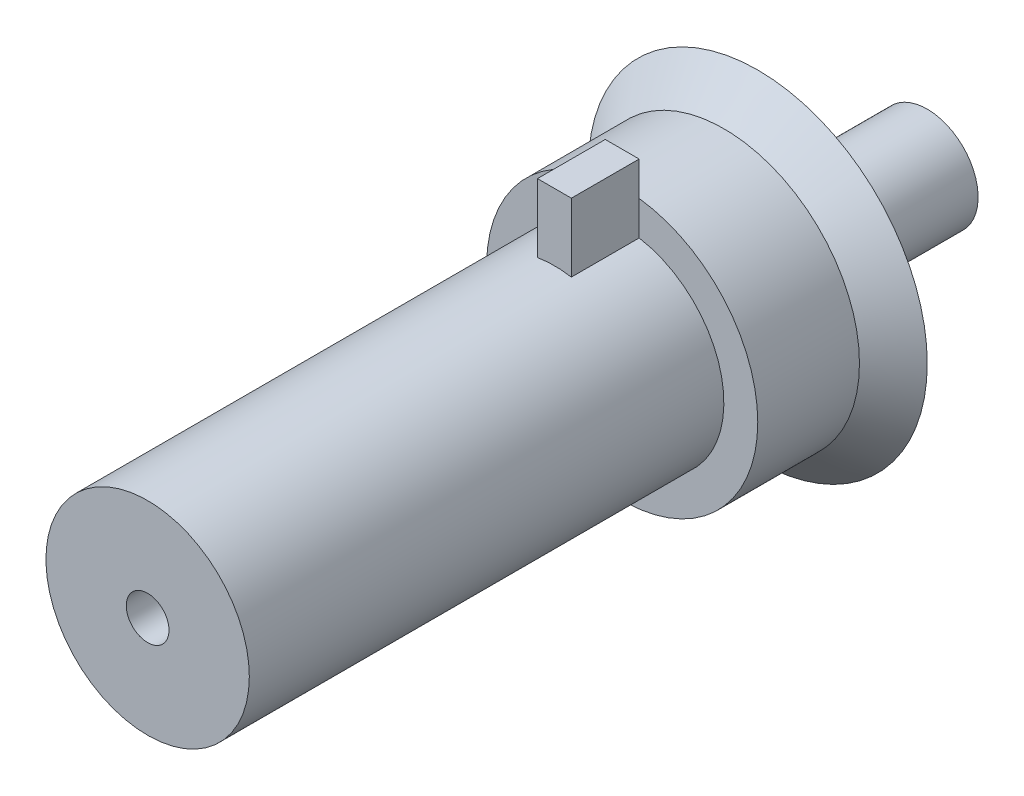
ISO-10303-21;
HEADER;
FILE_DESCRIPTION(('STEP AP214'),'2;1');
FILE_NAME('part.step','',(''),(''),'','','');
FILE_SCHEMA(('AUTOMOTIVE_DESIGN { 1 0 10303 214 1 1 1 1 }'));
ENDSEC;
DATA;
#1=APPLICATION_CONTEXT('core data for automotive mechanical design processes');
#2=APPLICATION_PROTOCOL_DEFINITION('international standard','automotive_design',2000,#1);
#3=PRODUCT_CONTEXT('',#1,'mechanical');
#4=PRODUCT('Part','Part','',(#3));
#5=PRODUCT_RELATED_PRODUCT_CATEGORY('part','',(#4));
#6=PRODUCT_DEFINITION_FORMATION('','',#4);
#7=PRODUCT_DEFINITION_CONTEXT('part definition',#1,'design');
#8=PRODUCT_DEFINITION('design','',#6,#7);
#9=PRODUCT_DEFINITION_SHAPE('','',#8);
#10=(LENGTH_UNIT() NAMED_UNIT(*) SI_UNIT(.MILLI.,.METRE.));
#11=(NAMED_UNIT(*) PLANE_ANGLE_UNIT() SI_UNIT($,.RADIAN.));
#12=(NAMED_UNIT(*) SI_UNIT($,.STERADIAN.) SOLID_ANGLE_UNIT());
#13=UNCERTAINTY_MEASURE_WITH_UNIT(LENGTH_MEASURE(1.E-05),#10,'distance_accuracy_value','');
#14=(GEOMETRIC_REPRESENTATION_CONTEXT(3) GLOBAL_UNCERTAINTY_ASSIGNED_CONTEXT((#13)) GLOBAL_UNIT_ASSIGNED_CONTEXT((#10,
#11,#12)) REPRESENTATION_CONTEXT('',''));
#15=CARTESIAN_POINT('',(0.,0.,0.));
#16=DIRECTION('',(0.,0.,1.));
#17=DIRECTION('',(1.,0.,0.));
#18=AXIS2_PLACEMENT_3D('',#15,#16,#17);
#19=CARTESIAN_POINT('',(0.,0.,80.));
#20=DIRECTION('',(0.,0.,-1.));
#21=DIRECTION('',(-1.,0.,0.));
#22=AXIS2_PLACEMENT_3D('',#19,#20,#21);
#23=CYLINDRICAL_SURFACE('',#22,15.);
#24=CARTESIAN_POINT('',(0.,0.,80.));
#25=DIRECTION('',(0.,0.,1.));
#26=DIRECTION('',(1.,0.,0.));
#27=AXIS2_PLACEMENT_3D('',#24,#25,#26);
#28=CIRCLE('',#27,15.);
#29=CARTESIAN_POINT('',(15.,0.,80.));
#30=VERTEX_POINT('',#29);
#31=EDGE_CURVE('E172',#30,#30,#28,.T.);
#32=ORIENTED_EDGE('',*,*,#31,.F.);
#33=EDGE_LOOP('',(#32));
#34=FACE_BOUND('',#33,.T.);
#35=DIRECTION('',(0.,0.,-1.));
#36=VECTOR('',#35,1.);
#37=CARTESIAN_POINT('',(-2.49684133813524,14.7907330221385,80.));
#38=LINE('',#37,#36);
#39=CARTESIAN_POINT('',(-2.49684133813524,14.7907330221385,9.99999999999999));
#40=VERTEX_POINT('',#39);
#41=CARTESIAN_POINT('',(-2.49684133813524,14.7907330221385,20.));
#42=VERTEX_POINT('',#41);
#43=EDGE_CURVE('E42',#40,#42,#38,.F.);
#44=ORIENTED_EDGE('',*,*,#43,.F.);
#45=CARTESIAN_POINT('',(0.,0.,9.99999999999999));
#46=DIRECTION('',(0.,0.,1.));
#47=DIRECTION('',(1.,0.,0.));
#48=AXIS2_PLACEMENT_3D('',#45,#46,#47);
#49=CIRCLE('',#48,15.);
#50=CARTESIAN_POINT('',(2.50315866186476,14.7896651995078,9.99999999999999));
#51=VERTEX_POINT('',#50);
#52=EDGE_CURVE('E57',#40,#51,#49,.T.);
#53=ORIENTED_EDGE('',*,*,#52,.T.);
#54=DIRECTION('',(0.,0.,-1.));
#55=VECTOR('',#54,1.);
#56=CARTESIAN_POINT('',(2.50315866186476,14.7896651995078,80.));
#57=LINE('',#56,#55);
#58=CARTESIAN_POINT('',(2.50315866186476,14.7896651995078,20.));
#59=VERTEX_POINT('',#58);
#60=EDGE_CURVE('E89',#59,#51,#57,.T.);
#61=ORIENTED_EDGE('',*,*,#60,.F.);
#62=CARTESIAN_POINT('',(0.,0.,20.));
#63=DIRECTION('',(0.,0.,-1.));
#64=DIRECTION('',(-1.,0.,0.));
#65=AXIS2_PLACEMENT_3D('',#62,#63,#64);
#66=CIRCLE('',#65,15.);
#67=EDGE_CURVE('E12',#42,#59,#66,.T.);
#68=ORIENTED_EDGE('',*,*,#67,.F.);
#69=EDGE_LOOP('',(#44,#53,#61,#68));
#70=FACE_BOUND('',#69,.T.);
#71=ADVANCED_FACE('F35',(#34,#70),#23,.T.);
#72=CARTESIAN_POINT('',(0.,0.,80.));
#73=DIRECTION('',(0.,0.,1.));
#74=DIRECTION('',(1.,0.,0.));
#75=AXIS2_PLACEMENT_3D('',#72,#73,#74);
#76=PLANE('',#75);
#77=CARTESIAN_POINT('',(0.,0.,80.));
#78=DIRECTION('',(0.,0.,1.));
#79=DIRECTION('',(1.,0.,0.));
#80=AXIS2_PLACEMENT_3D('',#77,#78,#79);
#81=CIRCLE('',#80,3.15);
#82=CARTESIAN_POINT('',(3.15,0.,80.));
#83=VERTEX_POINT('',#82);
#84=EDGE_CURVE('E110',#83,#83,#81,.T.);
#85=ORIENTED_EDGE('',*,*,#84,.F.);
#86=EDGE_LOOP('',(#85));
#87=FACE_BOUND('',#86,.T.);
#88=ORIENTED_EDGE('',*,*,#31,.T.);
#89=EDGE_LOOP('',(#88));
#90=FACE_BOUND('',#89,.T.);
#91=ADVANCED_FACE('F162',(#87,#90),#76,.T.);
#92=CARTESIAN_POINT('',(-2.49684133813524,-0.125631732372962,20.));
#93=DIRECTION('',(1.,0.,0.));
#94=DIRECTION('',(0.,0.,-1.));
#95=AXIS2_PLACEMENT_3D('',#92,#93,#94);
#96=PLANE('',#95);
#97=DIRECTION('',(0.,-1.,0.));
#98=VECTOR('',#97,1.);
#99=CARTESIAN_POINT('',(-2.49684133813524,-0.125631732372962,9.99999999999999));
#100=LINE('',#99,#98);
#101=CARTESIAN_POINT('',(-2.49684133813524,24.874368267627,9.99999999999999));
#102=VERTEX_POINT('',#101);
#103=CARTESIAN_POINT('',(-2.49684133813524,19.8435325315877,9.99999999999999));
#104=VERTEX_POINT('',#103);
#105=EDGE_CURVE('E96',#102,#104,#100,.T.);
#106=ORIENTED_EDGE('',*,*,#105,.T.);
#107=EDGE_CURVE('E101',#104,#40,#100,.T.);
#108=ORIENTED_EDGE('',*,*,#107,.T.);
#109=ORIENTED_EDGE('',*,*,#43,.T.);
#110=DIRECTION('',(0.,-1.,0.));
#111=VECTOR('',#110,1.);
#112=CARTESIAN_POINT('',(-2.49684133813524,-0.125631732372962,20.));
#113=LINE('',#112,#111);
#114=CARTESIAN_POINT('',(-2.49684133813524,24.874368267627,20.));
#115=VERTEX_POINT('',#114);
#116=EDGE_CURVE('E116',#115,#42,#113,.T.);
#117=ORIENTED_EDGE('',*,*,#116,.F.);
#118=DIRECTION('',(0.,0.,-1.));
#119=VECTOR('',#118,1.);
#120=CARTESIAN_POINT('',(-2.49684133813524,24.874368267627,20.));
#121=LINE('',#120,#119);
#122=EDGE_CURVE('E123',#115,#102,#121,.T.);
#123=ORIENTED_EDGE('',*,*,#122,.T.);
#124=EDGE_LOOP('',(#106,#108,#109,#117,#123));
#125=FACE_BOUND('',#124,.T.);
#126=ADVANCED_FACE('F179',(#125),#96,.F.);
#127=CARTESIAN_POINT('',(2.50315866186476,-0.125631732372962,20.));
#128=DIRECTION('',(-1.,0.,0.));
#129=DIRECTION('',(0.,0.,1.));
#130=AXIS2_PLACEMENT_3D('',#127,#128,#129);
#131=PLANE('',#130);
#132=DIRECTION('',(0.,1.,0.));
#133=VECTOR('',#132,1.);
#134=CARTESIAN_POINT('',(2.50315866186476,-0.125631732372962,20.));
#135=LINE('',#134,#133);
#136=CARTESIAN_POINT('',(2.50315866186476,24.874368267627,20.));
#137=VERTEX_POINT('',#136);
#138=EDGE_CURVE('E119',#59,#137,#135,.T.);
#139=ORIENTED_EDGE('',*,*,#138,.F.);
#140=ORIENTED_EDGE('',*,*,#60,.T.);
#141=DIRECTION('',(0.,1.,0.));
#142=VECTOR('',#141,1.);
#143=CARTESIAN_POINT('',(2.50315866186476,-0.125631732372962,9.99999999999999));
#144=LINE('',#143,#142);
#145=CARTESIAN_POINT('',(2.50315866186476,19.8427366235994,9.99999999999999));
#146=VERTEX_POINT('',#145);
#147=EDGE_CURVE('E83',#51,#146,#144,.T.);
#148=ORIENTED_EDGE('',*,*,#147,.T.);
#149=CARTESIAN_POINT('',(2.50315866186476,24.874368267627,9.99999999999999));
#150=VERTEX_POINT('',#149);
#151=EDGE_CURVE('E87',#146,#150,#144,.T.);
#152=ORIENTED_EDGE('',*,*,#151,.T.);
#153=DIRECTION('',(0.,0.,-1.));
#154=VECTOR('',#153,1.);
#155=CARTESIAN_POINT('',(2.50315866186476,24.874368267627,20.));
#156=LINE('',#155,#154);
#157=EDGE_CURVE('E128',#137,#150,#156,.T.);
#158=ORIENTED_EDGE('',*,*,#157,.F.);
#159=EDGE_LOOP('',(#139,#140,#148,#152,#158));
#160=FACE_BOUND('',#159,.T.);
#161=ADVANCED_FACE('F85',(#160),#131,.F.);
#162=CARTESIAN_POINT('',(0.,0.,20.));
#163=DIRECTION('',(0.,0.,-1.));
#164=DIRECTION('',(-1.,0.,0.));
#165=AXIS2_PLACEMENT_3D('',#162,#163,#164);
#166=PLANE('',#165);
#167=ORIENTED_EDGE('',*,*,#116,.T.);
#168=ORIENTED_EDGE('',*,*,#67,.T.);
#169=ORIENTED_EDGE('',*,*,#138,.T.);
#170=DIRECTION('',(-1.,0.,0.));
#171=VECTOR('',#170,1.);
#172=CARTESIAN_POINT('',(-2.49684133813524,24.874368267627,20.));
#173=LINE('',#172,#171);
#174=EDGE_CURVE('E121',#137,#115,#173,.T.);
#175=ORIENTED_EDGE('',*,*,#174,.T.);
#176=EDGE_LOOP('',(#167,#168,#169,#175));
#177=FACE_BOUND('',#176,.T.);
#178=ADVANCED_FACE('F182',(#177),#166,.F.);
#179=CARTESIAN_POINT('',(0.,0.,9.99999999999999));
#180=DIRECTION('',(0.,0.,-1.));
#181=DIRECTION('',(-1.,0.,0.));
#182=AXIS2_PLACEMENT_3D('',#179,#180,#181);
#183=PLANE('',#182);
#184=CARTESIAN_POINT('',(0.,0.,9.99999999999999));
#185=DIRECTION('',(0.,0.,1.));
#186=DIRECTION('',(1.,0.,0.));
#187=AXIS2_PLACEMENT_3D('',#184,#185,#186);
#188=CIRCLE('',#187,20.);
#189=EDGE_CURVE('E49',#146,#104,#188,.T.);
#190=ORIENTED_EDGE('',*,*,#189,.T.);
#191=ORIENTED_EDGE('',*,*,#105,.F.);
#192=DIRECTION('',(-1.,0.,0.));
#193=VECTOR('',#192,1.);
#194=CARTESIAN_POINT('',(-2.49684133813524,24.874368267627,9.99999999999999));
#195=LINE('',#194,#193);
#196=EDGE_CURVE('E92',#150,#102,#195,.T.);
#197=ORIENTED_EDGE('',*,*,#196,.F.);
#198=ORIENTED_EDGE('',*,*,#151,.F.);
#199=EDGE_LOOP('',(#190,#191,#197,#198));
#200=FACE_BOUND('',#199,.T.);
#201=ADVANCED_FACE('F95',(#200),#183,.T.);
#202=CARTESIAN_POINT('',(-2.49684133813524,24.874368267627,20.));
#203=DIRECTION('',(0.,-1.,0.));
#204=DIRECTION('',(0.,0.,-1.));
#205=AXIS2_PLACEMENT_3D('',#202,#203,#204);
#206=PLANE('',#205);
#207=ORIENTED_EDGE('',*,*,#196,.T.);
#208=ORIENTED_EDGE('',*,*,#122,.F.);
#209=ORIENTED_EDGE('',*,*,#174,.F.);
#210=ORIENTED_EDGE('',*,*,#157,.T.);
#211=EDGE_LOOP('',(#207,#208,#209,#210));
#212=FACE_BOUND('',#211,.T.);
#213=ADVANCED_FACE('F205',(#212),#206,.F.);
#214=CARTESIAN_POINT('',(0.,0.,74.));
#215=DIRECTION('',(0.,0.,1.));
#216=DIRECTION('',(1.,0.,0.));
#217=AXIS2_PLACEMENT_3D('',#214,#215,#216);
#218=CYLINDRICAL_SURFACE('',#217,3.15);
#219=CARTESIAN_POINT('',(0.,0.,74.));
#220=DIRECTION('',(0.,0.,1.));
#221=DIRECTION('',(1.,0.,0.));
#222=AXIS2_PLACEMENT_3D('',#219,#220,#221);
#223=CIRCLE('',#222,3.15);
#224=CARTESIAN_POINT('',(3.15,0.,74.));
#225=VERTEX_POINT('',#224);
#226=EDGE_CURVE('E111',#225,#225,#223,.T.);
#227=ORIENTED_EDGE('',*,*,#226,.F.);
#228=EDGE_LOOP('',(#227));
#229=FACE_BOUND('',#228,.T.);
#230=ORIENTED_EDGE('',*,*,#84,.T.);
#231=EDGE_LOOP('',(#230));
#232=FACE_BOUND('',#231,.T.);
#233=ADVANCED_FACE('F202',(#229,#232),#218,.F.);
#234=CARTESIAN_POINT('',(0.,0.,74.));
#235=DIRECTION('',(0.,0.,1.));
#236=DIRECTION('',(1.,0.,0.));
#237=AXIS2_PLACEMENT_3D('',#234,#235,#236);
#238=PLANE('',#237);
#239=ORIENTED_EDGE('',*,*,#226,.T.);
#240=EDGE_LOOP('',(#239));
#241=FACE_BOUND('',#240,.T.);
#242=ADVANCED_FACE('F204',(#241),#238,.T.);
#243=CARTESIAN_POINT('',(0.,0.,9.99999999999999));
#244=DIRECTION('',(0.,0.,1.));
#245=DIRECTION('',(1.,0.,0.));
#246=AXIS2_PLACEMENT_3D('',#243,#244,#245);
#247=PLANE('',#246);
#248=ORIENTED_EDGE('',*,*,#107,.F.);
#249=EDGE_CURVE('E99',#104,#146,#188,.T.);
#250=ORIENTED_EDGE('',*,*,#249,.T.);
#251=ORIENTED_EDGE('',*,*,#147,.F.);
#252=ORIENTED_EDGE('',*,*,#52,.F.);
#253=EDGE_LOOP('',(#248,#250,#251,#252));
#254=FACE_BOUND('',#253,.T.);
#255=ADVANCED_FACE('F100',(#254),#247,.T.);
#256=CARTESIAN_POINT('',(0.,0.,-5.));
#257=DIRECTION('',(0.,0.,1.));
#258=DIRECTION('',(1.,0.,0.));
#259=AXIS2_PLACEMENT_3D('',#256,#257,#258);
#260=CYLINDRICAL_SURFACE('',#259,20.);
#261=CARTESIAN_POINT('',(0.,0.,-5.));
#262=DIRECTION('',(0.,0.,1.));
#263=DIRECTION('',(1.,0.,0.));
#264=AXIS2_PLACEMENT_3D('',#261,#262,#263);
#265=CIRCLE('',#264,20.);
#266=CARTESIAN_POINT('',(20.,0.,-5.));
#267=VERTEX_POINT('',#266);
#268=EDGE_CURVE('E105',#267,#267,#265,.T.);
#269=ORIENTED_EDGE('',*,*,#268,.T.);
#270=EDGE_LOOP('',(#269));
#271=FACE_BOUND('',#270,.T.);
#272=ORIENTED_EDGE('',*,*,#189,.F.);
#273=ORIENTED_EDGE('',*,*,#249,.F.);
#274=EDGE_LOOP('',(#272,#273));
#275=FACE_BOUND('',#274,.T.);
#276=ADVANCED_FACE('F104',(#271,#275),#260,.T.);
#277=CARTESIAN_POINT('',(0.,0.,-35.));
#278=DIRECTION('',(0.,0.,-1.));
#279=DIRECTION('',(-1.,0.,0.));
#280=AXIS2_PLACEMENT_3D('',#277,#278,#279);
#281=PLANE('',#280);
#282=CARTESIAN_POINT('',(0.,0.,-35.));
#283=DIRECTION('',(0.,0.,-1.));
#284=DIRECTION('',(-1.,0.,0.));
#285=AXIS2_PLACEMENT_3D('',#282,#283,#284);
#286=CIRCLE('',#285,7.5);
#287=CARTESIAN_POINT('',(-7.5,0.,-35.));
#288=VERTEX_POINT('',#287);
#289=EDGE_CURVE('E131',#288,#288,#286,.T.);
#290=ORIENTED_EDGE('',*,*,#289,.T.);
#291=EDGE_LOOP('',(#290));
#292=FACE_BOUND('',#291,.T.);
#293=ADVANCED_FACE('F223',(#292),#281,.T.);
#294=CARTESIAN_POINT('',(0.,0.,-35.));
#295=DIRECTION('',(0.,0.,1.));
#296=DIRECTION('',(1.,0.,0.));
#297=AXIS2_PLACEMENT_3D('',#294,#295,#296);
#298=CYLINDRICAL_SURFACE('',#297,7.5);
#299=ORIENTED_EDGE('',*,*,#289,.F.);
#300=EDGE_LOOP('',(#299));
#301=FACE_BOUND('',#300,.T.);
#302=CARTESIAN_POINT('',(0.,0.,-10.));
#303=DIRECTION('',(0.,0.,-1.));
#304=DIRECTION('',(-1.,0.,0.));
#305=AXIS2_PLACEMENT_3D('',#302,#303,#304);
#306=CIRCLE('',#305,7.5);
#307=CARTESIAN_POINT('',(-7.5,0.,-10.));
#308=VERTEX_POINT('',#307);
#309=EDGE_CURVE('E130',#308,#308,#306,.T.);
#310=ORIENTED_EDGE('',*,*,#309,.T.);
#311=EDGE_LOOP('',(#310));
#312=FACE_BOUND('',#311,.T.);
#313=ADVANCED_FACE('F157',(#301,#312),#298,.T.);
#314=CARTESIAN_POINT('',(0.,0.,-10.));
#315=DIRECTION('',(0.,0.,-1.));
#316=DIRECTION('',(-1.,0.,0.));
#317=AXIS2_PLACEMENT_3D('',#314,#315,#316);
#318=PLANE('',#317);
#319=CARTESIAN_POINT('',(0.,0.,-10.));
#320=DIRECTION('',(0.,0.,-1.));
#321=DIRECTION('',(-1.,0.,0.));
#322=AXIS2_PLACEMENT_3D('',#319,#320,#321);
#323=CIRCLE('',#322,25.);
#324=CARTESIAN_POINT('',(-25.,0.,-10.));
#325=VERTEX_POINT('',#324);
#326=EDGE_CURVE('E134',#325,#325,#323,.T.);
#327=ORIENTED_EDGE('',*,*,#326,.T.);
#328=EDGE_LOOP('',(#327));
#329=FACE_BOUND('',#328,.T.);
#330=ORIENTED_EDGE('',*,*,#309,.F.);
#331=EDGE_LOOP('',(#330));
#332=FACE_BOUND('',#331,.T.);
#333=ADVANCED_FACE('F156',(#329,#332),#318,.T.);
#334=CARTESIAN_POINT('',(0.,0.,0.));
#335=DIRECTION('',(0.,0.,-1.));
#336=DIRECTION('',(-1.,0.,0.));
#337=AXIS2_PLACEMENT_3D('',#334,#335,#336);
#338=CONICAL_SURFACE('',#337,15.,0.785398163397448);
#339=ORIENTED_EDGE('',*,*,#326,.F.);
#340=EDGE_LOOP('',(#339));
#341=FACE_BOUND('',#340,.T.);
#342=ORIENTED_EDGE('',*,*,#268,.F.);
#343=EDGE_LOOP('',(#342));
#344=FACE_BOUND('',#343,.T.);
#345=ADVANCED_FACE('F146',(#341,#344),#338,.T.);
#346=CLOSED_SHELL('',(#71,#91,#126,#161,#178,#201,#213,#233,#242,#255,#276,#293,#313,#333,#345));
#347=MANIFOLD_SOLID_BREP('B2',#346);
#348=ADVANCED_BREP_SHAPE_REPRESENTATION('',(#18,#347),#14);
#349=SHAPE_DEFINITION_REPRESENTATION(#9,#348);
ENDSEC;
END-ISO-10303-21;
